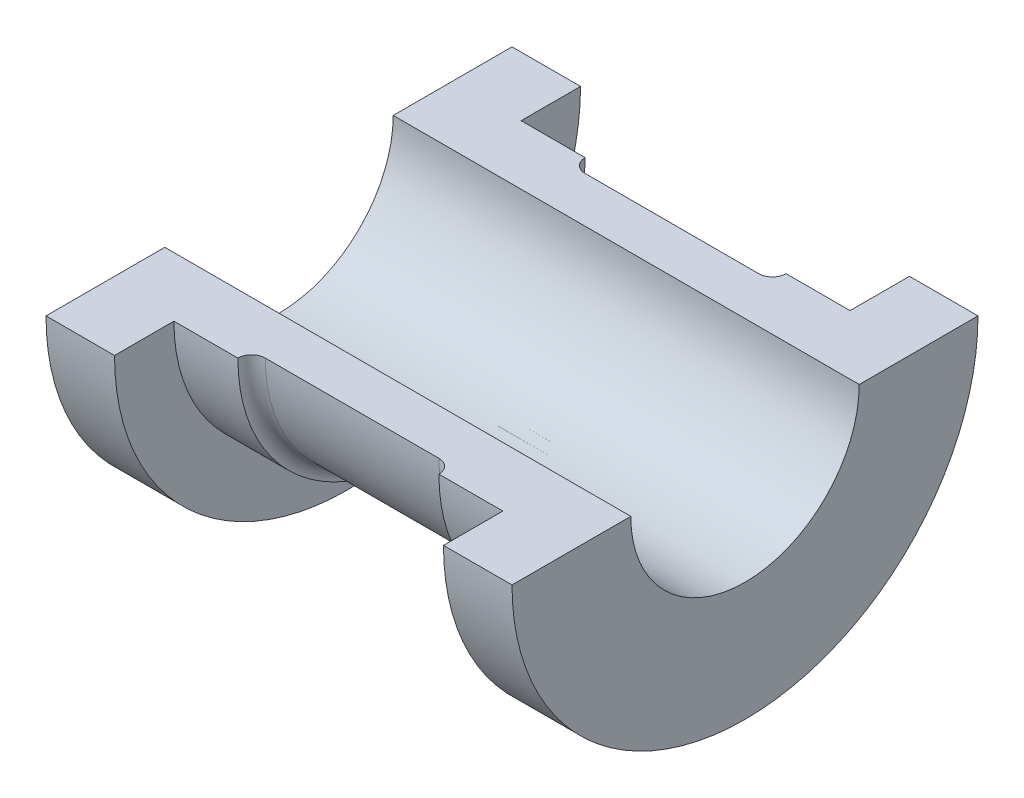
ISO-10303-21;
HEADER;
FILE_DESCRIPTION(('STEP AP214'),'2;1');
FILE_NAME('part.step','',(''),(''),'','','');
FILE_SCHEMA(('AUTOMOTIVE_DESIGN { 1 0 10303 214 1 1 1 1 }'));
ENDSEC;
DATA;
#1=APPLICATION_CONTEXT('core data for automotive mechanical design processes');
#2=APPLICATION_PROTOCOL_DEFINITION('international standard','automotive_design',2000,#1);
#3=PRODUCT_CONTEXT('',#1,'mechanical');
#4=PRODUCT('Part','Part','',(#3));
#5=PRODUCT_RELATED_PRODUCT_CATEGORY('part','',(#4));
#6=PRODUCT_DEFINITION_FORMATION('','',#4);
#7=PRODUCT_DEFINITION_CONTEXT('part definition',#1,'design');
#8=PRODUCT_DEFINITION('design','',#6,#7);
#9=PRODUCT_DEFINITION_SHAPE('','',#8);
#10=(LENGTH_UNIT() NAMED_UNIT(*) SI_UNIT(.MILLI.,.METRE.));
#11=(NAMED_UNIT(*) PLANE_ANGLE_UNIT() SI_UNIT($,.RADIAN.));
#12=(NAMED_UNIT(*) SI_UNIT($,.STERADIAN.) SOLID_ANGLE_UNIT());
#13=UNCERTAINTY_MEASURE_WITH_UNIT(LENGTH_MEASURE(1.E-05),#10,'distance_accuracy_value','');
#14=(GEOMETRIC_REPRESENTATION_CONTEXT(3) GLOBAL_UNCERTAINTY_ASSIGNED_CONTEXT((#13)) GLOBAL_UNIT_ASSIGNED_CONTEXT((#10,
#11,#12)) REPRESENTATION_CONTEXT('',''));
#15=CARTESIAN_POINT('',(0.,0.,0.));
#16=DIRECTION('',(0.,0.,1.));
#17=DIRECTION('',(1.,0.,0.));
#18=AXIS2_PLACEMENT_3D('',#15,#16,#17);
#19=CARTESIAN_POINT('',(25.5,-23.5,0.));
#20=DIRECTION('',(0.,1.,0.));
#21=DIRECTION('',(0.,0.,1.));
#22=AXIS2_PLACEMENT_3D('',#19,#20,#21);
#23=CYLINDRICAL_SURFACE('',#22,3.);
#24=CARTESIAN_POINT('',(25.5,-12.1346610995116,3.));
#25=CARTESIAN_POINT('',(25.6658863139436,-12.1346643709057,2.99999492639599));
#26=CARTESIAN_POINT('',(25.8318303018224,-12.1380998279897,2.98619401575549));
#27=CARTESIAN_POINT('',(26.1589683527196,-12.1514386999622,2.93143372377318));
#28=CARTESIAN_POINT('',(26.320159363488,-12.1613461803941,2.8904572712724));
#29=CARTESIAN_POINT('',(26.6330122954029,-12.1864438536979,2.78273587845348));
#30=CARTESIAN_POINT('',(26.784685634194,-12.2016275682829,2.71602252749926));
#31=CARTESIAN_POINT('',(27.0746995436572,-12.2355589227548,2.55881551789466));
#32=CARTESIAN_POINT('',(27.2130398236696,-12.2543066403104,2.46832134098416));
#33=CARTESIAN_POINT('',(27.4752688149402,-12.2936793084446,2.26416092165144));
#34=CARTESIAN_POINT('',(27.5988471559895,-12.3143323081787,2.15010136587795));
#35=CARTESIAN_POINT('',(27.8253153944342,-12.3549444196641,1.9028957631587));
#36=CARTESIAN_POINT('',(27.9282034711926,-12.3749034702238,1.7697480383165));
#37=CARTESIAN_POINT('',(28.111626432706,-12.4121875957975,1.48603435008244));
#38=CARTESIAN_POINT('',(28.1918585235493,-12.429475709008,1.33526735140697));
#39=CARTESIAN_POINT('',(28.3257265373178,-12.4591511096292,1.02190364344049));
#40=CARTESIAN_POINT('',(28.3793660681453,-12.471539061815,0.859308542342421));
#41=CARTESIAN_POINT('',(28.4575381543865,-12.4898200905274,0.530137152798906));
#42=CARTESIAN_POINT('',(28.4825972142082,-12.4958305032045,0.363692527540995));
#43=CARTESIAN_POINT('',(28.5045475196916,-12.5010873481438,0.0288605739758551));
#44=CARTESIAN_POINT('',(28.5014426159241,-12.5003347050497,-0.139526485618312));
#45=CARTESIAN_POINT('',(28.467536299215,-12.4922383642801,-0.469819197188799));
#46=CARTESIAN_POINT('',(28.4373029158314,-12.4850298487431,-0.631786969117108));
#47=CARTESIAN_POINT('',(28.3509082620371,-12.4649879597451,-0.948279915829275));
#48=CARTESIAN_POINT('',(28.2947456748971,-12.4521543006312,-1.10280471220598));
#49=CARTESIAN_POINT('',(28.1576131672522,-12.4220937673228,-1.40154850796015));
#50=CARTESIAN_POINT('',(28.0764367442316,-12.4048305309055,-1.54566890739798));
#51=CARTESIAN_POINT('',(27.8917365663337,-12.3677903650575,-1.8184437481507));
#52=CARTESIAN_POINT('',(27.7882091992267,-12.3480130295253,-1.94709568430374));
#53=CARTESIAN_POINT('',(27.5586845989154,-12.307523454591,-2.18866676072893));
#54=CARTESIAN_POINT('',(27.432190633831,-12.2868002024656,-2.30111257110785));
#55=CARTESIAN_POINT('',(27.1619243638416,-12.247210122564,-2.50329554889259));
#56=CARTESIAN_POINT('',(27.0181513760968,-12.2283433682075,-2.59303181841776));
#57=CARTESIAN_POINT('',(26.7165347437369,-12.1945661246798,-2.74751986313759));
#58=CARTESIAN_POINT('',(26.5586349489236,-12.1796724534131,-2.81216594132899));
#59=CARTESIAN_POINT('',(26.2337668765232,-12.155748323081,-2.91385324316721));
#60=CARTESIAN_POINT('',(26.0668003753167,-12.1467167199581,-2.95089985341171));
#61=CARTESIAN_POINT('',(25.7329066199321,-12.1357772660229,-2.99556850234642));
#62=CARTESIAN_POINT('',(25.5660779274892,-12.1337008786289,-3.0038868332891));
#63=CARTESIAN_POINT('',(25.2334168059252,-12.1364495609797,-2.99276203410493));
#64=CARTESIAN_POINT('',(25.0675842941963,-12.1412740503119,-2.97332123871795));
#65=CARTESIAN_POINT('',(24.7441540827391,-12.1571201522343,-2.90783852027801));
#66=CARTESIAN_POINT('',(24.5864708240831,-12.1680489760353,-2.86219461484813));
#67=CARTESIAN_POINT('',(24.2809921793329,-12.1947857126682,-2.74603914988784));
#68=CARTESIAN_POINT('',(24.1331978945637,-12.2105941678427,-2.6755248260303));
#69=CARTESIAN_POINT('',(23.848721247796,-12.2456689266469,-2.51014743676234));
#70=CARTESIAN_POINT('',(23.712290625994,-12.2649930224287,-2.41486385815303));
#71=CARTESIAN_POINT('',(23.4570992661061,-12.3047764880024,-2.2031905161038));
#72=CARTESIAN_POINT('',(23.3383411990146,-12.3252360287629,-2.08679756812262));
#73=CARTESIAN_POINT('',(23.1190849903908,-12.3655511140332,-1.8330286051264));
#74=CARTESIAN_POINT('',(23.0190662440103,-12.3853821651221,-1.69523379949055));
#75=CARTESIAN_POINT('',(22.843591536915,-12.4217193399952,-1.4043976180672));
#76=CARTESIAN_POINT('',(22.7681343275553,-12.438225632785,-1.25135701785302));
#77=CARTESIAN_POINT('',(22.644552522725,-12.4659520953338,-0.935406182533388));
#78=CARTESIAN_POINT('',(22.5962376794784,-12.4772089625634,-0.772573732033517));
#79=CARTESIAN_POINT('',(22.5277321796031,-12.4933282808784,-0.440797516621205));
#80=CARTESIAN_POINT('',(22.5075365472445,-12.4981918632553,-0.271854838350951));
#81=CARTESIAN_POINT('',(22.496104132213,-12.5009346170348,0.0628273325379125));
#82=CARTESIAN_POINT('',(22.5041572440584,-12.4989850590467,0.228541548592055));
#83=CARTESIAN_POINT('',(22.5473799630176,-12.4886960978661,0.556181588106277));
#84=CARTESIAN_POINT('',(22.5825488764087,-12.4803568581455,0.718107508375789));
#85=CARTESIAN_POINT('',(22.6786368251157,-12.4582475403262,1.03289533638029));
#86=CARTESIAN_POINT('',(22.7394365694408,-12.4445026408745,1.18579554017999));
#87=CARTESIAN_POINT('',(22.8849502441486,-12.4130357959962,1.47930912419136));
#88=CARTESIAN_POINT('',(22.9696669737463,-12.3953133850962,1.61992106367531));
#89=CARTESIAN_POINT('',(23.1628254742769,-12.3573152907204,1.88826701153781));
#90=CARTESIAN_POINT('',(23.2717550707436,-12.3369914041701,2.01564306622629));
#91=CARTESIAN_POINT('',(23.5092876105897,-12.2963112747441,2.25054951565269));
#92=CARTESIAN_POINT('',(23.6378954407363,-12.2759550250775,2.35807496614236));
#93=CARTESIAN_POINT('',(23.9137393941601,-12.2371275634283,2.5519948518568));
#94=CARTESIAN_POINT('',(24.061252620507,-12.2186938455572,2.63800316633773));
#95=CARTESIAN_POINT('',(24.3690618465055,-12.1862909651906,2.78387070894251));
#96=CARTESIAN_POINT('',(24.5293479156711,-12.1723183758181,2.84375002144868));
#97=CARTESIAN_POINT('',(24.8245928535141,-12.1527391085338,2.92614436386637));
#98=CARTESIAN_POINT('',(24.9580708282112,-12.1460087939348,2.95378236710749));
#99=CARTESIAN_POINT('',(25.2276863740708,-12.1369686046644,2.99071161192545));
#100=CARTESIAN_POINT('',(25.363823754423,-12.1346584140208,3.00000416492674));
#101=CARTESIAN_POINT('',(25.5,-12.1346610995116,3.));
#102=B_SPLINE_CURVE_WITH_KNOTS('',3,(#24,#25,#26,#27,#28,#29,#30,#31,#32,#33,#34,#35,#36,#37,
#38,#39,#40,#41,#42,#43,#44,#45,#46,#47,#48,#49,#50,#51,#52,#53,#54,#55,#56,#57,#58,#59,#60,#61,
#62,#63,#64,#65,#66,#67,#68,#69,#70,#71,#72,#73,#74,#75,#76,#77,#78,#79,#80,#81,#82,#83,#84,#85,
#86,#87,#88,#89,#90,#91,#92,#93,#94,#95,#96,#97,#98,#99,#100,#101),.UNSPECIFIED.,.T.,.F.,(4,2,2,
2,2,2,2,2,2,2,2,2,2,2,2,2,2,2,2,2,2,2,2,2,2,2,2,2,2,2,2,2,2,2,2,2,2,2,4),(0.,0.497159212189434,
0.994631026538901,1.49149417875255,1.98836816009861,2.49432418194046,3.00032470584734,
3.51279830766303,4.02520236141813,4.52800628486068,5.03074146609936,5.52318961529222,
6.01566277459447,6.51231571921414,7.00904899016387,7.51819168467208,8.02735450631452,
8.53863957226519,9.04982482437227,9.54852995993758,10.047193153326,10.5384749824062,
11.0298114342859,11.5301065260644,12.0304771548043,12.5422844123508,13.0540656468818,
13.5622134292334,14.0702712827588,14.5656502933719,15.0610166307768,15.5541024543049,
16.0472460119429,16.5514085771014,17.0556965465884,17.5684722794099,18.0808531634825,
18.4890008491296,18.8971193572843),.UNSPECIFIED.);
#103=CARTESIAN_POINT('',(25.5,-12.1346610995116,3.));
#104=VERTEX_POINT('',#103);
#105=EDGE_CURVE('E44',#104,#104,#102,.T.);
#106=ORIENTED_EDGE('',*,*,#105,.F.);
#107=EDGE_LOOP('',(#106));
#108=FACE_BOUND('',#107,.T.);
#109=CARTESIAN_POINT('',(25.5,-23.5,0.));
#110=DIRECTION('',(0.,1.,0.));
#111=DIRECTION('',(0.,0.,1.));
#112=AXIS2_PLACEMENT_3D('',#109,#110,#111);
#113=CIRCLE('',#112,3.);
#114=CARTESIAN_POINT('',(25.5,-23.5,3.));
#115=VERTEX_POINT('',#114);
#116=EDGE_CURVE('E11',#115,#115,#113,.T.);
#117=ORIENTED_EDGE('',*,*,#116,.T.);
#118=EDGE_LOOP('',(#117));
#119=FACE_BOUND('',#118,.T.);
#120=ADVANCED_FACE('F40',(#108,#119),#23,.T.);
#121=CARTESIAN_POINT('',(25.5,-23.5,0.));
#122=DIRECTION('',(0.,1.,0.));
#123=DIRECTION('',(0.,0.,1.));
#124=AXIS2_PLACEMENT_3D('',#121,#122,#123);
#125=PLANE('',#124);
#126=ORIENTED_EDGE('',*,*,#116,.F.);
#127=EDGE_LOOP('',(#126));
#128=FACE_BOUND('',#127,.T.);
#129=ADVANCED_FACE('F59',(#128),#125,.F.);
#130=CARTESIAN_POINT('',(0.,0.,0.));
#131=DIRECTION('',(1.,0.,0.));
#132=DIRECTION('',(0.,0.,-1.));
#133=AXIS2_PLACEMENT_3D('',#130,#131,#132);
#134=CYLINDRICAL_SURFACE('',#133,12.5);
#135=ORIENTED_EDGE('',*,*,#105,.T.);
#136=EDGE_LOOP('',(#135));
#137=FACE_BOUND('',#136,.T.);
#138=ADVANCED_FACE('F56',(#137),#134,.F.);
#139=CLOSED_SHELL('',(#120,#129,#138));
#140=MANIFOLD_SOLID_BREP('B2',#139);
#141=CARTESIAN_POINT('',(7.50000000000001,1.32676290876039E-13,-19.));
#142=DIRECTION('',(-1.,0.,0.));
#143=DIRECTION('',(0.,0.,1.));
#144=AXIS2_PLACEMENT_3D('',#141,#142,#143);
#145=PLANE('',#144);
#146=CARTESIAN_POINT('',(7.50000000000001,0.,0.));
#147=DIRECTION('',(-1.,0.,0.));
#148=DIRECTION('',(0.,0.,1.));
#149=AXIS2_PLACEMENT_3D('',#146,#147,#148);
#150=CIRCLE('',#149,19.);
#151=CARTESIAN_POINT('',(7.50000000000001,1.32676290876039E-13,-19.));
#152=VERTEX_POINT('',#151);
#153=CARTESIAN_POINT('',(7.50000000000001,0.,19.));
#154=VERTEX_POINT('',#153);
#155=EDGE_CURVE('E198',#152,#154,#150,.T.);
#156=ORIENTED_EDGE('',*,*,#155,.T.);
#157=DIRECTION('',(0.,0.,1.));
#158=VECTOR('',#157,1.);
#159=CARTESIAN_POINT('',(7.50000000000001,0.,19.));
#160=LINE('',#159,#158);
#161=CARTESIAN_POINT('',(7.50000000000001,0.,25.5));
#162=VERTEX_POINT('',#161);
#163=EDGE_CURVE('E193',#154,#162,#160,.T.);
#164=ORIENTED_EDGE('',*,*,#163,.T.);
#165=CARTESIAN_POINT('',(7.50000000000001,0.,0.));
#166=DIRECTION('',(-1.,0.,0.));
#167=DIRECTION('',(0.,0.,1.));
#168=AXIS2_PLACEMENT_3D('',#165,#166,#167);
#169=CIRCLE('',#168,25.5);
#170=CARTESIAN_POINT('',(7.50000000000001,1.78065548281E-13,-25.5));
#171=VERTEX_POINT('',#170);
#172=EDGE_CURVE('E175',#171,#162,#169,.T.);
#173=ORIENTED_EDGE('',*,*,#172,.F.);
#174=DIRECTION('',(0.,0.,-1.));
#175=VECTOR('',#174,1.);
#176=CARTESIAN_POINT('',(7.50000000000001,1.32676290876039E-13,-19.));
#177=LINE('',#176,#175);
#178=EDGE_CURVE('E222',#152,#171,#177,.T.);
#179=ORIENTED_EDGE('',*,*,#178,.F.);
#180=EDGE_LOOP('',(#156,#164,#173,#179));
#181=FACE_BOUND('',#180,.T.);
#182=ADVANCED_FACE('F85',(#181),#145,.F.);
#183=CARTESIAN_POINT('',(0.,0.,0.));
#184=DIRECTION('',(-1.,0.,0.));
#185=DIRECTION('',(0.,0.,1.));
#186=AXIS2_PLACEMENT_3D('',#183,#184,#185);
#187=CYLINDRICAL_SURFACE('',#186,19.);
#188=CARTESIAN_POINT('',(14.5,0.,0.));
#189=DIRECTION('',(-1.,0.,0.));
#190=DIRECTION('',(0.,0.,1.));
#191=AXIS2_PLACEMENT_3D('',#188,#189,#190);
#192=CIRCLE('',#191,19.);
#193=CARTESIAN_POINT('',(14.5,1.32676290876039E-13,-19.));
#194=VERTEX_POINT('',#193);
#195=CARTESIAN_POINT('',(14.5,0.,19.));
#196=VERTEX_POINT('',#195);
#197=EDGE_CURVE('E260',#194,#196,#192,.T.);
#198=ORIENTED_EDGE('',*,*,#197,.T.);
#199=DIRECTION('',(-1.,0.,0.));
#200=VECTOR('',#199,1.);
#201=CARTESIAN_POINT('',(14.5,0.,19.));
#202=LINE('',#201,#200);
#203=EDGE_CURVE('E220',#196,#154,#202,.T.);
#204=ORIENTED_EDGE('',*,*,#203,.T.);
#205=ORIENTED_EDGE('',*,*,#155,.F.);
#206=DIRECTION('',(-1.,0.,0.));
#207=VECTOR('',#206,1.);
#208=CARTESIAN_POINT('',(14.5,1.32676290876039E-13,-19.));
#209=LINE('',#208,#207);
#210=EDGE_CURVE('E187',#194,#152,#209,.T.);
#211=ORIENTED_EDGE('',*,*,#210,.F.);
#212=EDGE_LOOP('',(#198,#204,#205,#211));
#213=FACE_BOUND('',#212,.T.);
#214=ADVANCED_FACE('F279',(#213),#187,.T.);
#215=CARTESIAN_POINT('',(0.,0.,0.));
#216=DIRECTION('',(-1.,0.,0.));
#217=DIRECTION('',(0.,0.,1.));
#218=AXIS2_PLACEMENT_3D('',#215,#216,#217);
#219=CYLINDRICAL_SURFACE('',#218,17.5);
#220=DIRECTION('',(-1.,0.,0.));
#221=VECTOR('',#220,1.);
#222=CARTESIAN_POINT('',(36.5,1.2220184685951E-13,-17.5));
#223=LINE('',#222,#221);
#224=CARTESIAN_POINT('',(35.,1.2220184685951E-13,-17.5));
#225=VERTEX_POINT('',#224);
#226=CARTESIAN_POINT('',(16.,1.2220184685951E-13,-17.5));
#227=VERTEX_POINT('',#226);
#228=EDGE_CURVE('E242',#225,#227,#223,.T.);
#229=ORIENTED_EDGE('',*,*,#228,.F.);
#230=CARTESIAN_POINT('',(35.,0.,0.));
#231=DIRECTION('',(1.,0.,0.));
#232=DIRECTION('',(0.,0.,-1.));
#233=AXIS2_PLACEMENT_3D('',#230,#231,#232);
#234=CIRCLE('',#233,17.5);
#235=CARTESIAN_POINT('',(35.,0.,17.5));
#236=VERTEX_POINT('',#235);
#237=EDGE_CURVE('E265',#225,#236,#234,.F.);
#238=ORIENTED_EDGE('',*,*,#237,.T.);
#239=DIRECTION('',(-1.,0.,0.));
#240=VECTOR('',#239,1.);
#241=CARTESIAN_POINT('',(36.5,0.,17.5));
#242=LINE('',#241,#240);
#243=CARTESIAN_POINT('',(16.,0.,17.5));
#244=VERTEX_POINT('',#243);
#245=EDGE_CURVE('E218',#236,#244,#242,.T.);
#246=ORIENTED_EDGE('',*,*,#245,.T.);
#247=CARTESIAN_POINT('',(16.,0.,0.));
#248=DIRECTION('',(-1.,0.,0.));
#249=DIRECTION('',(0.,0.,1.));
#250=AXIS2_PLACEMENT_3D('',#247,#248,#249);
#251=CIRCLE('',#250,17.5);
#252=EDGE_CURVE('E100',#244,#227,#251,.F.);
#253=ORIENTED_EDGE('',*,*,#252,.T.);
#254=EDGE_LOOP('',(#229,#238,#246,#253));
#255=FACE_BOUND('',#254,.T.);
#256=ADVANCED_FACE('F273',(#255),#219,.T.);
#257=CARTESIAN_POINT('',(0.,0.,0.));
#258=DIRECTION('',(-1.,0.,0.));
#259=DIRECTION('',(0.,0.,1.));
#260=AXIS2_PLACEMENT_3D('',#257,#258,#259);
#261=CYLINDRICAL_SURFACE('',#260,19.);
#262=CARTESIAN_POINT('',(43.5,0.,0.));
#263=DIRECTION('',(-1.,0.,0.));
#264=DIRECTION('',(0.,0.,1.));
#265=AXIS2_PLACEMENT_3D('',#262,#263,#264);
#266=CIRCLE('',#265,19.);
#267=CARTESIAN_POINT('',(43.5,1.32676290876039E-13,-19.));
#268=VERTEX_POINT('',#267);
#269=CARTESIAN_POINT('',(43.5,0.,19.));
#270=VERTEX_POINT('',#269);
#271=EDGE_CURVE('E255',#268,#270,#266,.T.);
#272=ORIENTED_EDGE('',*,*,#271,.T.);
#273=DIRECTION('',(-1.,0.,0.));
#274=VECTOR('',#273,1.);
#275=CARTESIAN_POINT('',(43.5,0.,19.));
#276=LINE('',#275,#274);
#277=CARTESIAN_POINT('',(36.5,0.,19.));
#278=VERTEX_POINT('',#277);
#279=EDGE_CURVE('E215',#270,#278,#276,.T.);
#280=ORIENTED_EDGE('',*,*,#279,.T.);
#281=CARTESIAN_POINT('',(36.5,0.,0.));
#282=DIRECTION('',(-1.,0.,0.));
#283=DIRECTION('',(0.,0.,1.));
#284=AXIS2_PLACEMENT_3D('',#281,#282,#283);
#285=CIRCLE('',#284,19.);
#286=CARTESIAN_POINT('',(36.5,1.32676290876039E-13,-19.));
#287=VERTEX_POINT('',#286);
#288=EDGE_CURVE('E257',#287,#278,#285,.T.);
#289=ORIENTED_EDGE('',*,*,#288,.F.);
#290=DIRECTION('',(-1.,0.,0.));
#291=VECTOR('',#290,1.);
#292=CARTESIAN_POINT('',(43.5,1.32676290876039E-13,-19.));
#293=LINE('',#292,#291);
#294=EDGE_CURVE('E240',#268,#287,#293,.T.);
#295=ORIENTED_EDGE('',*,*,#294,.F.);
#296=EDGE_LOOP('',(#272,#280,#289,#295));
#297=FACE_BOUND('',#296,.T.);
#298=ADVANCED_FACE('F286',(#297),#261,.T.);
#299=CARTESIAN_POINT('',(43.5,1.78065548281E-13,-25.5));
#300=DIRECTION('',(1.,0.,0.));
#301=DIRECTION('',(0.,0.,-1.));
#302=AXIS2_PLACEMENT_3D('',#299,#300,#301);
#303=PLANE('',#302);
#304=CARTESIAN_POINT('',(43.5,0.,0.));
#305=DIRECTION('',(-1.,0.,0.));
#306=DIRECTION('',(0.,0.,1.));
#307=AXIS2_PLACEMENT_3D('',#304,#305,#306);
#308=CIRCLE('',#307,25.5);
#309=CARTESIAN_POINT('',(43.5,1.78065548281E-13,-25.5));
#310=VERTEX_POINT('',#309);
#311=CARTESIAN_POINT('',(43.5,0.,25.5));
#312=VERTEX_POINT('',#311);
#313=EDGE_CURVE('E253',#310,#312,#308,.T.);
#314=ORIENTED_EDGE('',*,*,#313,.T.);
#315=DIRECTION('',(0.,0.,-1.));
#316=VECTOR('',#315,1.);
#317=CARTESIAN_POINT('',(43.5,0.,25.5));
#318=LINE('',#317,#316);
#319=EDGE_CURVE('E212',#312,#270,#318,.T.);
#320=ORIENTED_EDGE('',*,*,#319,.T.);
#321=ORIENTED_EDGE('',*,*,#271,.F.);
#322=DIRECTION('',(0.,0.,1.));
#323=VECTOR('',#322,1.);
#324=CARTESIAN_POINT('',(43.5,1.78065548281E-13,-25.5));
#325=LINE('',#324,#323);
#326=EDGE_CURVE('E237',#310,#268,#325,.T.);
#327=ORIENTED_EDGE('',*,*,#326,.F.);
#328=EDGE_LOOP('',(#314,#320,#321,#327));
#329=FACE_BOUND('',#328,.T.);
#330=ADVANCED_FACE('F304',(#329),#303,.F.);
#331=CARTESIAN_POINT('',(0.,0.,0.));
#332=DIRECTION('',(-1.,0.,0.));
#333=DIRECTION('',(0.,0.,1.));
#334=AXIS2_PLACEMENT_3D('',#331,#332,#333);
#335=CYLINDRICAL_SURFACE('',#334,25.5);
#336=CARTESIAN_POINT('',(51.,0.,0.));
#337=DIRECTION('',(-1.,0.,0.));
#338=DIRECTION('',(0.,0.,1.));
#339=AXIS2_PLACEMENT_3D('',#336,#337,#338);
#340=CIRCLE('',#339,25.5);
#341=CARTESIAN_POINT('',(51.,1.78065548281E-13,-25.5));
#342=VERTEX_POINT('',#341);
#343=CARTESIAN_POINT('',(51.,0.,25.5));
#344=VERTEX_POINT('',#343);
#345=EDGE_CURVE('E251',#342,#344,#340,.T.);
#346=ORIENTED_EDGE('',*,*,#345,.T.);
#347=DIRECTION('',(-1.,0.,0.));
#348=VECTOR('',#347,1.);
#349=CARTESIAN_POINT('',(51.,0.,25.5));
#350=LINE('',#349,#348);
#351=EDGE_CURVE('E209',#344,#312,#350,.T.);
#352=ORIENTED_EDGE('',*,*,#351,.T.);
#353=ORIENTED_EDGE('',*,*,#313,.F.);
#354=DIRECTION('',(-1.,0.,0.));
#355=VECTOR('',#354,1.);
#356=CARTESIAN_POINT('',(51.,1.78065548281E-13,-25.5));
#357=LINE('',#356,#355);
#358=EDGE_CURVE('E234',#342,#310,#357,.T.);
#359=ORIENTED_EDGE('',*,*,#358,.F.);
#360=EDGE_LOOP('',(#346,#352,#353,#359));
#361=FACE_BOUND('',#360,.T.);
#362=ADVANCED_FACE('F308',(#361),#335,.T.);
#363=CARTESIAN_POINT('',(51.,0.,-12.5));
#364=DIRECTION('',(-1.,0.,0.));
#365=DIRECTION('',(0.,0.,1.));
#366=AXIS2_PLACEMENT_3D('',#363,#364,#365);
#367=PLANE('',#366);
#368=CARTESIAN_POINT('',(51.,0.,0.));
#369=DIRECTION('',(-1.,0.,0.));
#370=DIRECTION('',(0.,0.,1.));
#371=AXIS2_PLACEMENT_3D('',#368,#369,#370);
#372=CIRCLE('',#371,12.5);
#373=CARTESIAN_POINT('',(51.,0.,-12.5));
#374=VERTEX_POINT('',#373);
#375=CARTESIAN_POINT('',(51.,0.,12.5));
#376=VERTEX_POINT('',#375);
#377=EDGE_CURVE('E249',#374,#376,#372,.T.);
#378=ORIENTED_EDGE('',*,*,#377,.T.);
#379=DIRECTION('',(0.,0.,1.));
#380=VECTOR('',#379,1.);
#381=CARTESIAN_POINT('',(51.,0.,12.5));
#382=LINE('',#381,#380);
#383=EDGE_CURVE('E206',#376,#344,#382,.T.);
#384=ORIENTED_EDGE('',*,*,#383,.T.);
#385=ORIENTED_EDGE('',*,*,#345,.F.);
#386=DIRECTION('',(0.,0.,-1.));
#387=VECTOR('',#386,1.);
#388=CARTESIAN_POINT('',(51.,0.,-12.5));
#389=LINE('',#388,#387);
#390=EDGE_CURVE('E231',#374,#342,#389,.T.);
#391=ORIENTED_EDGE('',*,*,#390,.F.);
#392=EDGE_LOOP('',(#378,#384,#385,#391));
#393=FACE_BOUND('',#392,.T.);
#394=ADVANCED_FACE('F312',(#393),#367,.F.);
#395=CARTESIAN_POINT('',(0.,0.,0.));
#396=DIRECTION('',(-1.,0.,0.));
#397=DIRECTION('',(0.,0.,1.));
#398=AXIS2_PLACEMENT_3D('',#395,#396,#397);
#399=CYLINDRICAL_SURFACE('',#398,12.5);
#400=CARTESIAN_POINT('',(0.,0.,0.));
#401=DIRECTION('',(-1.,0.,0.));
#402=DIRECTION('',(0.,0.,1.));
#403=AXIS2_PLACEMENT_3D('',#400,#401,#402);
#404=CIRCLE('',#403,12.5);
#405=CARTESIAN_POINT('',(0.,0.,-12.5));
#406=VERTEX_POINT('',#405);
#407=CARTESIAN_POINT('',(0.,0.,12.5));
#408=VERTEX_POINT('',#407);
#409=EDGE_CURVE('E247',#406,#408,#404,.T.);
#410=ORIENTED_EDGE('',*,*,#409,.T.);
#411=DIRECTION('',(1.,0.,0.));
#412=VECTOR('',#411,1.);
#413=CARTESIAN_POINT('',(0.,0.,12.5));
#414=LINE('',#413,#412);
#415=EDGE_CURVE('E203',#408,#376,#414,.T.);
#416=ORIENTED_EDGE('',*,*,#415,.T.);
#417=ORIENTED_EDGE('',*,*,#377,.F.);
#418=DIRECTION('',(1.,0.,0.));
#419=VECTOR('',#418,1.);
#420=CARTESIAN_POINT('',(0.,0.,-12.5));
#421=LINE('',#420,#419);
#422=EDGE_CURVE('E228',#406,#374,#421,.T.);
#423=ORIENTED_EDGE('',*,*,#422,.F.);
#424=EDGE_LOOP('',(#410,#416,#417,#423));
#425=FACE_BOUND('',#424,.T.);
#426=ADVANCED_FACE('F315',(#425),#399,.F.);
#427=CARTESIAN_POINT('',(0.,0.,-12.5));
#428=DIRECTION('',(-1.,0.,0.));
#429=DIRECTION('',(0.,0.,1.));
#430=AXIS2_PLACEMENT_3D('',#427,#428,#429);
#431=PLANE('',#430);
#432=CARTESIAN_POINT('',(0.,0.,0.));
#433=DIRECTION('',(-1.,0.,0.));
#434=DIRECTION('',(0.,0.,1.));
#435=AXIS2_PLACEMENT_3D('',#432,#433,#434);
#436=CIRCLE('',#435,25.5);
#437=CARTESIAN_POINT('',(0.,1.78065548281E-13,-25.5));
#438=VERTEX_POINT('',#437);
#439=CARTESIAN_POINT('',(0.,0.,25.5));
#440=VERTEX_POINT('',#439);
#441=EDGE_CURVE('E186',#438,#440,#436,.T.);
#442=ORIENTED_EDGE('',*,*,#441,.T.);
#443=DIRECTION('',(0.,0.,1.));
#444=VECTOR('',#443,1.);
#445=CARTESIAN_POINT('',(0.,0.,12.5));
#446=LINE('',#445,#444);
#447=EDGE_CURVE('E196',#408,#440,#446,.T.);
#448=ORIENTED_EDGE('',*,*,#447,.F.);
#449=ORIENTED_EDGE('',*,*,#409,.F.);
#450=DIRECTION('',(0.,0.,-1.));
#451=VECTOR('',#450,1.);
#452=CARTESIAN_POINT('',(0.,0.,-12.5));
#453=LINE('',#452,#451);
#454=EDGE_CURVE('E225',#406,#438,#453,.T.);
#455=ORIENTED_EDGE('',*,*,#454,.T.);
#456=EDGE_LOOP('',(#442,#448,#449,#455));
#457=FACE_BOUND('',#456,.T.);
#458=ADVANCED_FACE('F318',(#457),#431,.T.);
#459=CARTESIAN_POINT('',(0.,0.,0.));
#460=DIRECTION('',(-1.,0.,0.));
#461=DIRECTION('',(0.,0.,1.));
#462=AXIS2_PLACEMENT_3D('',#459,#460,#461);
#463=CYLINDRICAL_SURFACE('',#462,25.5);
#464=DIRECTION('',(1.,0.,0.));
#465=VECTOR('',#464,1.);
#466=CARTESIAN_POINT('',(0.,1.78065548281E-13,-25.5));
#467=LINE('',#466,#465);
#468=EDGE_CURVE('E181',#438,#171,#467,.T.);
#469=ORIENTED_EDGE('',*,*,#468,.T.);
#470=ORIENTED_EDGE('',*,*,#172,.T.);
#471=DIRECTION('',(1.,0.,0.));
#472=VECTOR('',#471,1.);
#473=CARTESIAN_POINT('',(0.,0.,25.5));
#474=LINE('',#473,#472);
#475=EDGE_CURVE('E178',#440,#162,#474,.T.);
#476=ORIENTED_EDGE('',*,*,#475,.F.);
#477=ORIENTED_EDGE('',*,*,#441,.F.);
#478=EDGE_LOOP('',(#469,#470,#476,#477));
#479=FACE_BOUND('',#478,.T.);
#480=ADVANCED_FACE('F177',(#479),#463,.T.);
#481=CARTESIAN_POINT('',(0.,0.,0.));
#482=DIRECTION('',(0.,-1.,0.));
#483=DIRECTION('',(0.,0.,-1.));
#484=AXIS2_PLACEMENT_3D('',#481,#482,#483);
#485=PLANE('',#484);
#486=ORIENTED_EDGE('',*,*,#178,.T.);
#487=ORIENTED_EDGE('',*,*,#468,.F.);
#488=ORIENTED_EDGE('',*,*,#454,.F.);
#489=ORIENTED_EDGE('',*,*,#422,.T.);
#490=ORIENTED_EDGE('',*,*,#390,.T.);
#491=ORIENTED_EDGE('',*,*,#358,.T.);
#492=ORIENTED_EDGE('',*,*,#326,.T.);
#493=ORIENTED_EDGE('',*,*,#294,.T.);
#494=CARTESIAN_POINT('',(35.,1.32676290876039E-13,-19.));
#495=DIRECTION('',(0.,-1.,0.));
#496=DIRECTION('',(0.,0.,-1.));
#497=AXIS2_PLACEMENT_3D('',#494,#495,#496);
#498=CIRCLE('',#497,1.5);
#499=EDGE_CURVE('E107',#287,#225,#498,.T.);
#500=ORIENTED_EDGE('',*,*,#499,.T.);
#501=ORIENTED_EDGE('',*,*,#228,.T.);
#502=CARTESIAN_POINT('',(16.,1.32676290876039E-13,-19.));
#503=DIRECTION('',(0.,-1.,0.));
#504=DIRECTION('',(0.,0.,-1.));
#505=AXIS2_PLACEMENT_3D('',#502,#503,#504);
#506=CIRCLE('',#505,1.5);
#507=EDGE_CURVE('E38',#227,#194,#506,.T.);
#508=ORIENTED_EDGE('',*,*,#507,.T.);
#509=ORIENTED_EDGE('',*,*,#210,.T.);
#510=EDGE_LOOP('',(#486,#487,#488,#489,#490,#491,#492,#493,#500,#501,#508,#509));
#511=FACE_BOUND('',#510,.T.);
#512=ADVANCED_FACE('F277',(#511),#485,.F.);
#513=CARTESIAN_POINT('',(0.,0.,0.));
#514=DIRECTION('',(0.,1.,0.));
#515=DIRECTION('',(0.,0.,1.));
#516=AXIS2_PLACEMENT_3D('',#513,#514,#515);
#517=PLANE('',#516);
#518=ORIENTED_EDGE('',*,*,#163,.F.);
#519=ORIENTED_EDGE('',*,*,#203,.F.);
#520=CARTESIAN_POINT('',(16.,0.,19.));
#521=DIRECTION('',(0.,1.,0.));
#522=DIRECTION('',(0.,0.,1.));
#523=AXIS2_PLACEMENT_3D('',#520,#521,#522);
#524=CIRCLE('',#523,1.5);
#525=EDGE_CURVE('E93',#196,#244,#524,.F.);
#526=ORIENTED_EDGE('',*,*,#525,.T.);
#527=ORIENTED_EDGE('',*,*,#245,.F.);
#528=CARTESIAN_POINT('',(35.,0.,19.));
#529=DIRECTION('',(0.,1.,0.));
#530=DIRECTION('',(0.,0.,1.));
#531=AXIS2_PLACEMENT_3D('',#528,#529,#530);
#532=CIRCLE('',#531,1.5);
#533=EDGE_CURVE('E268',#236,#278,#532,.F.);
#534=ORIENTED_EDGE('',*,*,#533,.T.);
#535=ORIENTED_EDGE('',*,*,#279,.F.);
#536=ORIENTED_EDGE('',*,*,#319,.F.);
#537=ORIENTED_EDGE('',*,*,#351,.F.);
#538=ORIENTED_EDGE('',*,*,#383,.F.);
#539=ORIENTED_EDGE('',*,*,#415,.F.);
#540=ORIENTED_EDGE('',*,*,#447,.T.);
#541=ORIENTED_EDGE('',*,*,#475,.T.);
#542=EDGE_LOOP('',(#518,#519,#526,#527,#534,#535,#536,#537,#538,#539,#540,#541));
#543=FACE_BOUND('',#542,.T.);
#544=ADVANCED_FACE('F191',(#543),#517,.T.);
#545=CARTESIAN_POINT('',(35.,0.,0.));
#546=DIRECTION('',(1.,0.,0.));
#547=DIRECTION('',(0.,0.,-1.));
#548=AXIS2_PLACEMENT_3D('',#545,#546,#547);
#549=TOROIDAL_SURFACE('',#548,19.,1.5);
#550=ORIENTED_EDGE('',*,*,#499,.F.);
#551=ORIENTED_EDGE('',*,*,#288,.T.);
#552=ORIENTED_EDGE('',*,*,#533,.F.);
#553=ORIENTED_EDGE('',*,*,#237,.F.);
#554=EDGE_LOOP('',(#550,#551,#552,#553));
#555=FACE_BOUND('',#554,.T.);
#556=ADVANCED_FACE('F290',(#555),#549,.F.);
#557=CARTESIAN_POINT('',(16.,0.,0.));
#558=DIRECTION('',(-1.,0.,0.));
#559=DIRECTION('',(0.,0.,1.));
#560=AXIS2_PLACEMENT_3D('',#557,#558,#559);
#561=TOROIDAL_SURFACE('',#560,19.,1.5);
#562=ORIENTED_EDGE('',*,*,#507,.F.);
#563=ORIENTED_EDGE('',*,*,#252,.F.);
#564=ORIENTED_EDGE('',*,*,#525,.F.);
#565=ORIENTED_EDGE('',*,*,#197,.F.);
#566=EDGE_LOOP('',(#562,#563,#564,#565));
#567=FACE_BOUND('',#566,.T.);
#568=ADVANCED_FACE('F87',(#567),#561,.F.);
#569=CLOSED_SHELL('',(#182,#214,#256,#298,#330,#362,#394,#426,#458,#480,#512,#544,#556,#568));
#570=MANIFOLD_SOLID_BREP('B6',#569);
#571=ADVANCED_BREP_SHAPE_REPRESENTATION('',(#18,#140,#570),#14);
#572=SHAPE_DEFINITION_REPRESENTATION(#9,#571);
ENDSEC;
END-ISO-10303-21;
